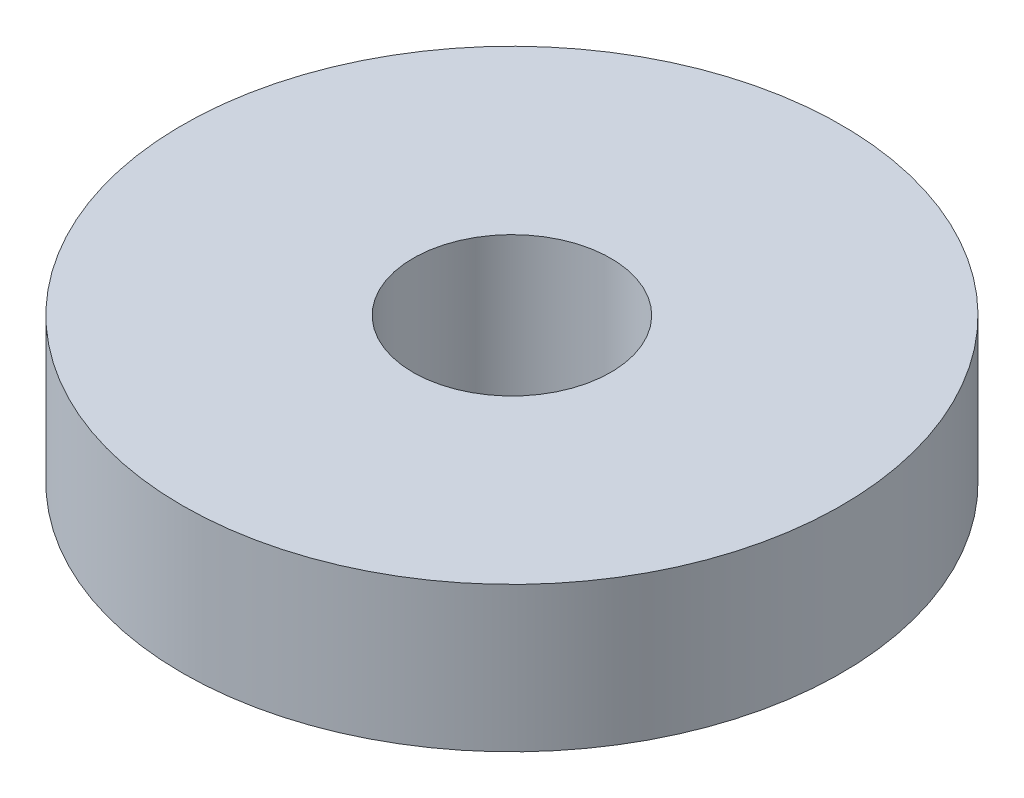
ISO-10303-21;
HEADER;
FILE_DESCRIPTION(('STEP AP214'),'2;1');
FILE_NAME('part.step','',(''),(''),'','','');
FILE_SCHEMA(('AUTOMOTIVE_DESIGN { 1 0 10303 214 1 1 1 1 }'));
ENDSEC;
DATA;
#1=APPLICATION_CONTEXT('core data for automotive mechanical design processes');
#2=APPLICATION_PROTOCOL_DEFINITION('international standard','automotive_design',2000,#1);
#3=PRODUCT_CONTEXT('',#1,'mechanical');
#4=PRODUCT('Part','Part','',(#3));
#5=PRODUCT_RELATED_PRODUCT_CATEGORY('part','',(#4));
#6=PRODUCT_DEFINITION_FORMATION('','',#4);
#7=PRODUCT_DEFINITION_CONTEXT('part definition',#1,'design');
#8=PRODUCT_DEFINITION('design','',#6,#7);
#9=PRODUCT_DEFINITION_SHAPE('','',#8);
#10=(LENGTH_UNIT() NAMED_UNIT(*) SI_UNIT(.MILLI.,.METRE.));
#11=(NAMED_UNIT(*) PLANE_ANGLE_UNIT() SI_UNIT($,.RADIAN.));
#12=(NAMED_UNIT(*) SI_UNIT($,.STERADIAN.) SOLID_ANGLE_UNIT());
#13=UNCERTAINTY_MEASURE_WITH_UNIT(LENGTH_MEASURE(1.E-05),#10,'distance_accuracy_value','');
#14=(GEOMETRIC_REPRESENTATION_CONTEXT(3) GLOBAL_UNCERTAINTY_ASSIGNED_CONTEXT((#13)) GLOBAL_UNIT_ASSIGNED_CONTEXT((#10,
#11,#12)) REPRESENTATION_CONTEXT('',''));
#15=CARTESIAN_POINT('',(0.,0.,0.));
#16=DIRECTION('',(0.,0.,1.));
#17=DIRECTION('',(1.,0.,0.));
#18=AXIS2_PLACEMENT_3D('',#15,#16,#17);
#19=CARTESIAN_POINT('',(0.,22.,0.));
#20=DIRECTION('',(0.,-1.,0.));
#21=DIRECTION('',(0.,0.,-1.));
#22=AXIS2_PLACEMENT_3D('',#19,#20,#21);
#23=CYLINDRICAL_SURFACE('',#22,50.);
#24=CARTESIAN_POINT('',(0.,22.,0.));
#25=DIRECTION('',(0.,1.,0.));
#26=DIRECTION('',(0.,0.,1.));
#27=AXIS2_PLACEMENT_3D('',#24,#25,#26);
#28=CIRCLE('',#27,50.);
#29=CARTESIAN_POINT('',(0.,22.,50.));
#30=VERTEX_POINT('',#29);
#31=EDGE_CURVE('E10',#30,#30,#28,.T.);
#32=ORIENTED_EDGE('',*,*,#31,.F.);
#33=EDGE_LOOP('',(#32));
#34=FACE_BOUND('',#33,.T.);
#35=CARTESIAN_POINT('',(0.,0.,0.));
#36=DIRECTION('',(0.,1.,0.));
#37=DIRECTION('',(0.,0.,1.));
#38=AXIS2_PLACEMENT_3D('',#35,#36,#37);
#39=CIRCLE('',#38,50.);
#40=CARTESIAN_POINT('',(0.,0.,50.));
#41=VERTEX_POINT('',#40);
#42=EDGE_CURVE('E37',#41,#41,#39,.T.);
#43=ORIENTED_EDGE('',*,*,#42,.T.);
#44=EDGE_LOOP('',(#43));
#45=FACE_BOUND('',#44,.T.);
#46=ADVANCED_FACE('F40',(#34,#45),#23,.T.);
#47=CARTESIAN_POINT('',(0.,22.,0.));
#48=DIRECTION('',(0.,1.,0.));
#49=DIRECTION('',(0.,0.,1.));
#50=AXIS2_PLACEMENT_3D('',#47,#48,#49);
#51=PLANE('',#50);
#52=CARTESIAN_POINT('',(0.,22.,0.));
#53=DIRECTION('',(0.,1.,0.));
#54=DIRECTION('',(0.,0.,1.));
#55=AXIS2_PLACEMENT_3D('',#52,#53,#54);
#56=CIRCLE('',#55,15.);
#57=CARTESIAN_POINT('',(0.,22.,15.));
#58=VERTEX_POINT('',#57);
#59=EDGE_CURVE('E50',#58,#58,#56,.T.);
#60=ORIENTED_EDGE('',*,*,#59,.F.);
#61=EDGE_LOOP('',(#60));
#62=FACE_BOUND('',#61,.T.);
#63=ORIENTED_EDGE('',*,*,#31,.T.);
#64=EDGE_LOOP('',(#63));
#65=FACE_BOUND('',#64,.T.);
#66=ADVANCED_FACE('F59',(#62,#65),#51,.T.);
#67=CARTESIAN_POINT('',(0.,0.,0.));
#68=DIRECTION('',(0.,1.,0.));
#69=DIRECTION('',(0.,0.,1.));
#70=AXIS2_PLACEMENT_3D('',#67,#68,#69);
#71=PLANE('',#70);
#72=CARTESIAN_POINT('',(0.,0.,0.));
#73=DIRECTION('',(0.,1.,0.));
#74=DIRECTION('',(0.,0.,1.));
#75=AXIS2_PLACEMENT_3D('',#72,#73,#74);
#76=CIRCLE('',#75,15.);
#77=CARTESIAN_POINT('',(0.,0.,15.));
#78=VERTEX_POINT('',#77);
#79=EDGE_CURVE('E47',#78,#78,#76,.T.);
#80=ORIENTED_EDGE('',*,*,#79,.T.);
#81=EDGE_LOOP('',(#80));
#82=FACE_BOUND('',#81,.T.);
#83=ORIENTED_EDGE('',*,*,#42,.F.);
#84=EDGE_LOOP('',(#83));
#85=FACE_BOUND('',#84,.T.);
#86=ADVANCED_FACE('F58',(#82,#85),#71,.F.);
#87=CARTESIAN_POINT('',(0.,22.,0.));
#88=DIRECTION('',(0.,-1.,0.));
#89=DIRECTION('',(0.,0.,-1.));
#90=AXIS2_PLACEMENT_3D('',#87,#88,#89);
#91=CYLINDRICAL_SURFACE('',#90,15.);
#92=ORIENTED_EDGE('',*,*,#59,.T.);
#93=EDGE_LOOP('',(#92));
#94=FACE_BOUND('',#93,.T.);
#95=ORIENTED_EDGE('',*,*,#79,.F.);
#96=EDGE_LOOP('',(#95));
#97=FACE_BOUND('',#96,.T.);
#98=ADVANCED_FACE('F54',(#94,#97),#91,.F.);
#99=CLOSED_SHELL('',(#46,#66,#86,#98));
#100=MANIFOLD_SOLID_BREP('B2',#99);
#101=ADVANCED_BREP_SHAPE_REPRESENTATION('',(#18,#100),#14);
#102=SHAPE_DEFINITION_REPRESENTATION(#9,#101);
ENDSEC;
END-ISO-10303-21;
